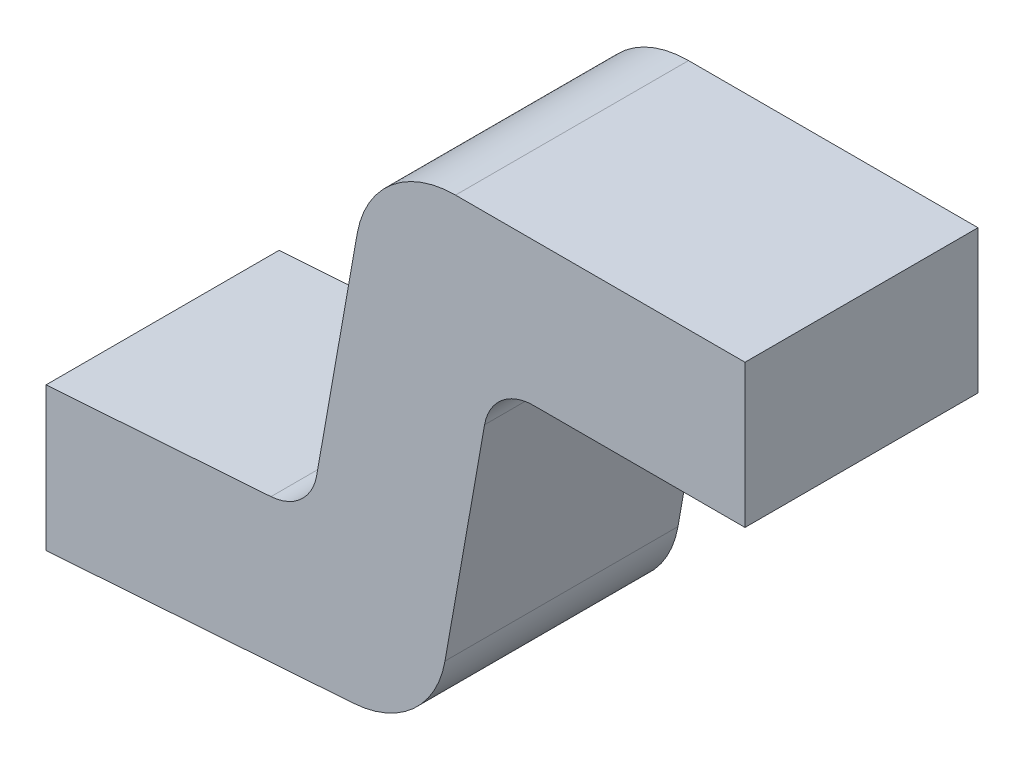
ISO-10303-21;
HEADER;
FILE_DESCRIPTION(('STEP AP214'),'2;1');
FILE_NAME('part.step','',(''),(''),'','','');
FILE_SCHEMA(('AUTOMOTIVE_DESIGN { 1 0 10303 214 1 1 1 1 }'));
ENDSEC;
DATA;
#1=APPLICATION_CONTEXT('core data for automotive mechanical design processes');
#2=APPLICATION_PROTOCOL_DEFINITION('international standard','automotive_design',2000,#1);
#3=PRODUCT_CONTEXT('',#1,'mechanical');
#4=PRODUCT('Part','Part','',(#3));
#5=PRODUCT_RELATED_PRODUCT_CATEGORY('part','',(#4));
#6=PRODUCT_DEFINITION_FORMATION('','',#4);
#7=PRODUCT_DEFINITION_CONTEXT('part definition',#1,'design');
#8=PRODUCT_DEFINITION('design','',#6,#7);
#9=PRODUCT_DEFINITION_SHAPE('','',#8);
#10=(LENGTH_UNIT() NAMED_UNIT(*) SI_UNIT(.MILLI.,.METRE.));
#11=(NAMED_UNIT(*) PLANE_ANGLE_UNIT() SI_UNIT($,.RADIAN.));
#12=(NAMED_UNIT(*) SI_UNIT($,.STERADIAN.) SOLID_ANGLE_UNIT());
#13=UNCERTAINTY_MEASURE_WITH_UNIT(LENGTH_MEASURE(1.E-05),#10,'distance_accuracy_value','');
#14=(GEOMETRIC_REPRESENTATION_CONTEXT(3) GLOBAL_UNCERTAINTY_ASSIGNED_CONTEXT((#13)) GLOBAL_UNIT_ASSIGNED_CONTEXT((#10,
#11,#12)) REPRESENTATION_CONTEXT('',''));
#15=CARTESIAN_POINT('',(0.,0.,0.));
#16=DIRECTION('',(0.,0.,1.));
#17=DIRECTION('',(1.,0.,0.));
#18=AXIS2_PLACEMENT_3D('',#15,#16,#17);
#19=CARTESIAN_POINT('',(0.526665309674,0.392731120359,0.));
#20=DIRECTION('',(0.,0.,1.));
#21=DIRECTION('',(1.,0.,0.));
#22=AXIS2_PLACEMENT_3D('',#19,#20,#21);
#23=PLANE('',#22);
#24=DIRECTION('',(0.997564050259825,0.0697564737441177,0.));
#25=VECTOR('',#24,1.);
#26=CARTESIAN_POINT('',(0.,0.,0.));
#27=LINE('',#26,#25);
#28=CARTESIAN_POINT('',(0.,0.,0.));
#29=VERTEX_POINT('',#28);
#30=CARTESIAN_POINT('',(0.462092631901793,0.032312664571475,0.));
#31=VERTEX_POINT('',#30);
#32=EDGE_CURVE('E106',#29,#31,#27,.T.);
#33=ORIENTED_EDGE('',*,*,#32,.F.);
#34=DIRECTION('',(0.,-1.,0.));
#35=VECTOR('',#34,1.);
#36=CARTESIAN_POINT('',(0.,0.215525008087,0.));
#37=LINE('',#36,#35);
#38=CARTESIAN_POINT('',(0.,0.215525008087024,0.));
#39=VERTEX_POINT('',#38);
#40=EDGE_CURVE('E130',#39,#29,#37,.T.);
#41=ORIENTED_EDGE('',*,*,#40,.F.);
#42=DIRECTION('',(-0.997564050259825,-0.0697564737441177,0.));
#43=VECTOR('',#42,1.);
#44=CARTESIAN_POINT('',(0.396435130538,0.243246452908,0.));
#45=LINE('',#44,#43);
#46=CARTESIAN_POINT('',(0.337981446488916,0.239158973136095,0.));
#47=VERTEX_POINT('',#46);
#48=EDGE_CURVE('E132',#47,#39,#45,.T.);
#49=ORIENTED_EDGE('',*,*,#48,.F.);
#50=CARTESIAN_POINT('',(0.332749710958,0.313976276906,0.));
#51=DIRECTION('',(0.,0.,1.));
#52=DIRECTION('',(1.,0.,0.));
#53=AXIS2_PLACEMENT_3D('',#50,#51,#52);
#54=CIRCLE('',#53,0.075);
#55=CARTESIAN_POINT('',(0.406610292433879,0.300952663581,0.));
#56=VERTEX_POINT('',#55);
#57=EDGE_CURVE('E176',#47,#56,#54,.T.);
#58=ORIENTED_EDGE('',*,*,#57,.T.);
#59=DIRECTION('',(-0.173648177667033,-0.98480775301219,0.));
#60=VECTOR('',#59,1.);
#61=CARTESIAN_POINT('',(0.489315993074,0.77,0.));
#62=LINE('',#61,#60);
#63=CARTESIAN_POINT('',(0.467459774798741,0.64604722665,0.));
#64=VERTEX_POINT('',#63);
#65=EDGE_CURVE('E140',#64,#56,#62,.T.);
#66=ORIENTED_EDGE('',*,*,#65,.F.);
#67=CARTESIAN_POINT('',(0.61518093775,0.62,0.));
#68=DIRECTION('',(0.,0.,1.));
#69=DIRECTION('',(1.,0.,0.));
#70=AXIS2_PLACEMENT_3D('',#67,#68,#69);
#71=CIRCLE('',#70,0.15);
#72=CARTESIAN_POINT('',(0.61518093775,0.77,0.));
#73=VERTEX_POINT('',#72);
#74=EDGE_CURVE('E179',#73,#64,#71,.T.);
#75=ORIENTED_EDGE('',*,*,#74,.F.);
#76=DIRECTION('',(-1.,0.,0.));
#77=VECTOR('',#76,1.);
#78=CARTESIAN_POINT('',(1.05,0.77,0.));
#79=LINE('',#78,#77);
#80=CARTESIAN_POINT('',(1.05,0.77,0.));
#81=VERTEX_POINT('',#80);
#82=EDGE_CURVE('E144',#81,#73,#79,.T.);
#83=ORIENTED_EDGE('',*,*,#82,.F.);
#84=DIRECTION('',(0.,1.,0.));
#85=VECTOR('',#84,1.);
#86=CARTESIAN_POINT('',(1.05,0.555,0.));
#87=LINE('',#86,#85);
#88=CARTESIAN_POINT('',(1.05,0.555,0.));
#89=VERTEX_POINT('',#88);
#90=EDGE_CURVE('E150',#89,#81,#87,.T.);
#91=ORIENTED_EDGE('',*,*,#90,.F.);
#92=DIRECTION('',(1.,0.,0.));
#93=VECTOR('',#92,1.);
#94=CARTESIAN_POINT('',(0.669722413777,0.555,0.));
#95=LINE('',#94,#93);
#96=CARTESIAN_POINT('',(0.732654886115,0.555,0.));
#97=VERTEX_POINT('',#96);
#98=EDGE_CURVE('E153',#97,#89,#95,.T.);
#99=ORIENTED_EDGE('',*,*,#98,.F.);
#100=CARTESIAN_POINT('',(0.732654886115,0.48,0.));
#101=DIRECTION('',(0.,0.,1.));
#102=DIRECTION('',(1.,0.,0.));
#103=AXIS2_PLACEMENT_3D('',#100,#101,#102);
#104=CIRCLE('',#103,0.075);
#105=CARTESIAN_POINT('',(0.658794304639196,0.493023613324987,0.));
#106=VERTEX_POINT('',#105);
#107=EDGE_CURVE('E180',#97,#106,#104,.T.);
#108=ORIENTED_EDGE('',*,*,#107,.T.);
#109=DIRECTION('',(0.173648177667033,0.98480775301219,0.));
#110=VECTOR('',#109,1.);
#111=CARTESIAN_POINT('',(0.579,0.04048762411529,0.));
#112=LINE('',#111,#110);
#113=CARTESIAN_POINT('',(0.599350323791972,0.155900045459962,0.));
#114=VERTEX_POINT('',#113);
#115=EDGE_CURVE('E108',#114,#106,#112,.T.);
#116=ORIENTED_EDGE('',*,*,#115,.F.);
#117=CARTESIAN_POINT('',(0.45162916084,0.18194727211,0.));
#118=DIRECTION('',(0.,0.,1.));
#119=DIRECTION('',(1.,0.,0.));
#120=AXIS2_PLACEMENT_3D('',#117,#118,#119);
#121=CIRCLE('',#120,0.15);
#122=EDGE_CURVE('E20',#31,#114,#121,.T.);
#123=ORIENTED_EDGE('',*,*,#122,.F.);
#124=EDGE_LOOP('',(#33,#41,#49,#58,#66,#75,#83,#91,#99,#108,#116,#123));
#125=FACE_BOUND('',#124,.T.);
#126=ADVANCED_FACE('F17',(#125),#23,.F.);
#127=CARTESIAN_POINT('',(0.45162916084,0.18194727211,0.));
#128=DIRECTION('',(0.,0.,1.));
#129=DIRECTION('',(1.,0.,0.));
#130=AXIS2_PLACEMENT_3D('',#127,#128,#129);
#131=CYLINDRICAL_SURFACE('',#130,0.15);
#132=ORIENTED_EDGE('',*,*,#122,.T.);
#133=DIRECTION('',(0.,0.,1.));
#134=VECTOR('',#133,1.);
#135=CARTESIAN_POINT('',(0.599350323791979,0.155900045460004,0.));
#136=LINE('',#135,#134);
#137=CARTESIAN_POINT('',(0.599350323791995,0.155900045460032,0.35));
#138=VERTEX_POINT('',#137);
#139=EDGE_CURVE('E111',#138,#114,#136,.F.);
#140=ORIENTED_EDGE('',*,*,#139,.F.);
#141=CARTESIAN_POINT('',(0.45162916084,0.18194727211,0.35));
#142=DIRECTION('',(0.,0.,1.));
#143=DIRECTION('',(1.,0.,0.));
#144=AXIS2_PLACEMENT_3D('',#141,#142,#143);
#145=CIRCLE('',#144,0.15);
#146=CARTESIAN_POINT('',(0.462092631901792,0.0323126645714702,0.35));
#147=VERTEX_POINT('',#146);
#148=EDGE_CURVE('E116',#147,#138,#145,.T.);
#149=ORIENTED_EDGE('',*,*,#148,.F.);
#150=DIRECTION('',(0.,0.,1.));
#151=VECTOR('',#150,1.);
#152=CARTESIAN_POINT('',(0.462092631901999,0.0323126645714894,0.));
#153=LINE('',#152,#151);
#154=EDGE_CURVE('E113',#31,#147,#153,.T.);
#155=ORIENTED_EDGE('',*,*,#154,.F.);
#156=EDGE_LOOP('',(#132,#140,#149,#155));
#157=FACE_BOUND('',#156,.T.);
#158=ADVANCED_FACE('F114',(#157),#131,.T.);
#159=CARTESIAN_POINT('',(0.579,0.04048762411529,0.));
#160=DIRECTION('',(0.98480775301219,-0.173648177667033,0.));
#161=DIRECTION('',(0.173648177667033,0.98480775301219,0.));
#162=AXIS2_PLACEMENT_3D('',#159,#160,#161);
#163=PLANE('',#162);
#164=ORIENTED_EDGE('',*,*,#139,.T.);
#165=ORIENTED_EDGE('',*,*,#115,.T.);
#166=DIRECTION('',(0.,0.,1.));
#167=VECTOR('',#166,1.);
#168=CARTESIAN_POINT('',(0.658794304639078,0.493023613324986,0.));
#169=LINE('',#168,#167);
#170=CARTESIAN_POINT('',(0.658794304639037,0.493023613324978,0.35));
#171=VERTEX_POINT('',#170);
#172=EDGE_CURVE('E162',#106,#171,#169,.T.);
#173=ORIENTED_EDGE('',*,*,#172,.T.);
#174=DIRECTION('',(0.173648177666078,0.984807753012358,0.));
#175=VECTOR('',#174,1.);
#176=CARTESIAN_POINT('',(0.599350323792,0.15590004546,0.35));
#177=LINE('',#176,#175);
#178=EDGE_CURVE('E122',#138,#171,#177,.T.);
#179=ORIENTED_EDGE('',*,*,#178,.F.);
#180=EDGE_LOOP('',(#164,#165,#173,#179));
#181=FACE_BOUND('',#180,.T.);
#182=ADVANCED_FACE('F346',(#181),#163,.T.);
#183=CARTESIAN_POINT('',(0.732654886115,0.48,0.));
#184=DIRECTION('',(0.,0.,1.));
#185=DIRECTION('',(1.,0.,0.));
#186=AXIS2_PLACEMENT_3D('',#183,#184,#185);
#187=CYLINDRICAL_SURFACE('',#186,0.075);
#188=DIRECTION('',(0.,0.,1.));
#189=VECTOR('',#188,1.);
#190=CARTESIAN_POINT('',(0.732654886115,0.555,0.));
#191=LINE('',#190,#189);
#192=CARTESIAN_POINT('',(0.732654886115,0.555,0.35));
#193=VERTEX_POINT('',#192);
#194=EDGE_CURVE('E158',#193,#97,#191,.F.);
#195=ORIENTED_EDGE('',*,*,#194,.F.);
#196=CARTESIAN_POINT('',(0.732654886115,0.48,0.35));
#197=DIRECTION('',(0.,0.,1.));
#198=DIRECTION('',(1.,0.,0.));
#199=AXIS2_PLACEMENT_3D('',#196,#197,#198);
#200=CIRCLE('',#199,0.075);
#201=EDGE_CURVE('E172',#171,#193,#200,.F.);
#202=ORIENTED_EDGE('',*,*,#201,.F.);
#203=ORIENTED_EDGE('',*,*,#172,.F.);
#204=ORIENTED_EDGE('',*,*,#107,.F.);
#205=EDGE_LOOP('',(#195,#202,#203,#204));
#206=FACE_BOUND('',#205,.T.);
#207=ADVANCED_FACE('F336',(#206),#187,.F.);
#208=CARTESIAN_POINT('',(0.669722413777,0.555,0.));
#209=DIRECTION('',(0.,-1.,0.));
#210=DIRECTION('',(1.,0.,0.));
#211=AXIS2_PLACEMENT_3D('',#208,#209,#210);
#212=PLANE('',#211);
#213=DIRECTION('',(0.,0.,1.));
#214=VECTOR('',#213,1.);
#215=CARTESIAN_POINT('',(1.05,0.555,0.));
#216=LINE('',#215,#214);
#217=CARTESIAN_POINT('',(1.05,0.555,0.35));
#218=VERTEX_POINT('',#217);
#219=EDGE_CURVE('E152',#218,#89,#216,.F.);
#220=ORIENTED_EDGE('',*,*,#219,.F.);
#221=DIRECTION('',(1.,0.,0.));
#222=VECTOR('',#221,1.);
#223=CARTESIAN_POINT('',(0.526665309674,0.555,0.35));
#224=LINE('',#223,#222);
#225=EDGE_CURVE('E174',#193,#218,#224,.T.);
#226=ORIENTED_EDGE('',*,*,#225,.F.);
#227=ORIENTED_EDGE('',*,*,#194,.T.);
#228=ORIENTED_EDGE('',*,*,#98,.T.);
#229=EDGE_LOOP('',(#220,#226,#227,#228));
#230=FACE_BOUND('',#229,.T.);
#231=ADVANCED_FACE('F326',(#230),#212,.T.);
#232=CARTESIAN_POINT('',(1.05,0.555,0.));
#233=DIRECTION('',(1.,0.,0.));
#234=DIRECTION('',(0.,1.,0.));
#235=AXIS2_PLACEMENT_3D('',#232,#233,#234);
#236=PLANE('',#235);
#237=DIRECTION('',(0.,1.,0.));
#238=VECTOR('',#237,1.);
#239=CARTESIAN_POINT('',(1.05,0.392731120359,0.35));
#240=LINE('',#239,#238);
#241=CARTESIAN_POINT('',(1.05,0.77,0.35));
#242=VERTEX_POINT('',#241);
#243=EDGE_CURVE('E195',#218,#242,#240,.T.);
#244=ORIENTED_EDGE('',*,*,#243,.F.);
#245=ORIENTED_EDGE('',*,*,#219,.T.);
#246=ORIENTED_EDGE('',*,*,#90,.T.);
#247=DIRECTION('',(0.,0.,1.));
#248=VECTOR('',#247,1.);
#249=CARTESIAN_POINT('',(1.05,0.77,0.));
#250=LINE('',#249,#248);
#251=EDGE_CURVE('E147',#242,#81,#250,.F.);
#252=ORIENTED_EDGE('',*,*,#251,.F.);
#253=EDGE_LOOP('',(#244,#245,#246,#252));
#254=FACE_BOUND('',#253,.T.);
#255=ADVANCED_FACE('F316',(#254),#236,.T.);
#256=CARTESIAN_POINT('',(1.05,0.77,0.));
#257=DIRECTION('',(0.,1.,0.));
#258=DIRECTION('',(-1.,0.,0.));
#259=AXIS2_PLACEMENT_3D('',#256,#257,#258);
#260=PLANE('',#259);
#261=ORIENTED_EDGE('',*,*,#251,.T.);
#262=ORIENTED_EDGE('',*,*,#82,.T.);
#263=DIRECTION('',(0.,0.,1.));
#264=VECTOR('',#263,1.);
#265=CARTESIAN_POINT('',(0.61518093775,0.77,0.));
#266=LINE('',#265,#264);
#267=CARTESIAN_POINT('',(0.61518093775,0.77,0.35));
#268=VERTEX_POINT('',#267);
#269=EDGE_CURVE('E146',#268,#73,#266,.F.);
#270=ORIENTED_EDGE('',*,*,#269,.F.);
#271=DIRECTION('',(1.,0.,0.));
#272=VECTOR('',#271,1.);
#273=CARTESIAN_POINT('',(0.526665309674,0.77,0.35));
#274=LINE('',#273,#272);
#275=EDGE_CURVE('E171',#242,#268,#274,.F.);
#276=ORIENTED_EDGE('',*,*,#275,.F.);
#277=EDGE_LOOP('',(#261,#262,#270,#276));
#278=FACE_BOUND('',#277,.T.);
#279=ADVANCED_FACE('F306',(#278),#260,.T.);
#280=CARTESIAN_POINT('',(0.61518093775,0.62,0.));
#281=DIRECTION('',(0.,0.,1.));
#282=DIRECTION('',(1.,0.,0.));
#283=AXIS2_PLACEMENT_3D('',#280,#281,#282);
#284=CYLINDRICAL_SURFACE('',#283,0.15);
#285=ORIENTED_EDGE('',*,*,#74,.T.);
#286=DIRECTION('',(0.,0.,1.));
#287=VECTOR('',#286,1.);
#288=CARTESIAN_POINT('',(0.467459774798748,0.646047226650044,0.));
#289=LINE('',#288,#287);
#290=CARTESIAN_POINT('',(0.46745977479887,0.646047226649999,0.35));
#291=VERTEX_POINT('',#290);
#292=EDGE_CURVE('E143',#291,#64,#289,.F.);
#293=ORIENTED_EDGE('',*,*,#292,.F.);
#294=CARTESIAN_POINT('',(0.61518093775,0.62,0.35));
#295=DIRECTION('',(0.,0.,1.));
#296=DIRECTION('',(1.,0.,0.));
#297=AXIS2_PLACEMENT_3D('',#294,#295,#296);
#298=CIRCLE('',#297,0.15);
#299=EDGE_CURVE('E168',#268,#291,#298,.T.);
#300=ORIENTED_EDGE('',*,*,#299,.F.);
#301=ORIENTED_EDGE('',*,*,#269,.T.);
#302=EDGE_LOOP('',(#285,#293,#300,#301));
#303=FACE_BOUND('',#302,.T.);
#304=ADVANCED_FACE('F296',(#303),#284,.T.);
#305=CARTESIAN_POINT('',(0.489315993074,0.77,0.));
#306=DIRECTION('',(-0.98480775301219,0.173648177667033,0.));
#307=DIRECTION('',(-0.173648177667033,-0.98480775301219,0.));
#308=AXIS2_PLACEMENT_3D('',#305,#306,#307);
#309=PLANE('',#308);
#310=ORIENTED_EDGE('',*,*,#292,.T.);
#311=ORIENTED_EDGE('',*,*,#65,.T.);
#312=DIRECTION('',(0.,0.,1.));
#313=VECTOR('',#312,1.);
#314=CARTESIAN_POINT('',(0.406610292433922,0.300952663581014,0.));
#315=LINE('',#314,#313);
#316=CARTESIAN_POINT('',(0.406610292433955,0.300952663580976,0.35));
#317=VERTEX_POINT('',#316);
#318=EDGE_CURVE('E142',#56,#317,#315,.T.);
#319=ORIENTED_EDGE('',*,*,#318,.T.);
#320=DIRECTION('',(-0.173648177667308,-0.984807753012142,0.));
#321=VECTOR('',#320,1.);
#322=CARTESIAN_POINT('',(0.467459774799,0.64604722665,0.35));
#323=LINE('',#322,#321);
#324=EDGE_CURVE('E167',#291,#317,#323,.T.);
#325=ORIENTED_EDGE('',*,*,#324,.F.);
#326=EDGE_LOOP('',(#310,#311,#319,#325));
#327=FACE_BOUND('',#326,.T.);
#328=ADVANCED_FACE('F286',(#327),#309,.T.);
#329=CARTESIAN_POINT('',(0.332749710958,0.313976276906,0.));
#330=DIRECTION('',(0.,0.,1.));
#331=DIRECTION('',(1.,0.,0.));
#332=AXIS2_PLACEMENT_3D('',#329,#330,#331);
#333=CYLINDRICAL_SURFACE('',#332,0.075);
#334=DIRECTION('',(0.,0.,1.));
#335=VECTOR('',#334,1.);
#336=CARTESIAN_POINT('',(0.337981446488993,0.2391589731361,0.));
#337=LINE('',#336,#335);
#338=CARTESIAN_POINT('',(0.337981446488916,0.239158973136044,0.35));
#339=VERTEX_POINT('',#338);
#340=EDGE_CURVE('E137',#339,#47,#337,.F.);
#341=ORIENTED_EDGE('',*,*,#340,.F.);
#342=CARTESIAN_POINT('',(0.332749710958,0.313976276906,0.35));
#343=DIRECTION('',(0.,0.,1.));
#344=DIRECTION('',(1.,0.,0.));
#345=AXIS2_PLACEMENT_3D('',#342,#343,#344);
#346=CIRCLE('',#345,0.075);
#347=EDGE_CURVE('E163',#317,#339,#346,.F.);
#348=ORIENTED_EDGE('',*,*,#347,.F.);
#349=ORIENTED_EDGE('',*,*,#318,.F.);
#350=ORIENTED_EDGE('',*,*,#57,.F.);
#351=EDGE_LOOP('',(#341,#348,#349,#350));
#352=FACE_BOUND('',#351,.T.);
#353=ADVANCED_FACE('F252',(#352),#333,.F.);
#354=CARTESIAN_POINT('',(0.396435130538,0.243246452908,0.));
#355=DIRECTION('',(-0.0697564737441177,0.997564050259825,0.));
#356=DIRECTION('',(-0.997564050259825,-0.0697564737441177,0.));
#357=AXIS2_PLACEMENT_3D('',#354,#355,#356);
#358=PLANE('',#357);
#359=DIRECTION('',(0.,0.,1.));
#360=VECTOR('',#359,1.);
#361=CARTESIAN_POINT('',(0.,0.215525008087,0.));
#362=LINE('',#361,#360);
#363=CARTESIAN_POINT('',(0.,0.215525008087,0.35));
#364=VERTEX_POINT('',#363);
#365=EDGE_CURVE('E118',#364,#39,#362,.F.);
#366=ORIENTED_EDGE('',*,*,#365,.F.);
#367=DIRECTION('',(-0.997564050259831,-0.0697564737440315,0.));
#368=VECTOR('',#367,1.);
#369=CARTESIAN_POINT('',(0.337981446489,0.239158973136,0.35));
#370=LINE('',#369,#368);
#371=EDGE_CURVE('E166',#339,#364,#370,.T.);
#372=ORIENTED_EDGE('',*,*,#371,.F.);
#373=ORIENTED_EDGE('',*,*,#340,.T.);
#374=ORIENTED_EDGE('',*,*,#48,.T.);
#375=EDGE_LOOP('',(#366,#372,#373,#374));
#376=FACE_BOUND('',#375,.T.);
#377=ADVANCED_FACE('F241',(#376),#358,.T.);
#378=CARTESIAN_POINT('',(0.,0.215525008087,0.));
#379=DIRECTION('',(-1.,0.,0.));
#380=DIRECTION('',(0.,-1.,0.));
#381=AXIS2_PLACEMENT_3D('',#378,#379,#380);
#382=PLANE('',#381);
#383=DIRECTION('',(0.,1.,0.));
#384=VECTOR('',#383,1.);
#385=CARTESIAN_POINT('',(0.,0.392731120359,0.35));
#386=LINE('',#385,#384);
#387=CARTESIAN_POINT('',(0.,0.,0.35));
#388=VERTEX_POINT('',#387);
#389=EDGE_CURVE('E26',#364,#388,#386,.F.);
#390=ORIENTED_EDGE('',*,*,#389,.F.);
#391=ORIENTED_EDGE('',*,*,#365,.T.);
#392=ORIENTED_EDGE('',*,*,#40,.T.);
#393=DIRECTION('',(0.,0.,1.));
#394=VECTOR('',#393,1.);
#395=CARTESIAN_POINT('',(0.,0.,0.));
#396=LINE('',#395,#394);
#397=EDGE_CURVE('E35',#388,#29,#396,.F.);
#398=ORIENTED_EDGE('',*,*,#397,.F.);
#399=EDGE_LOOP('',(#390,#391,#392,#398));
#400=FACE_BOUND('',#399,.T.);
#401=ADVANCED_FACE('F243',(#400),#382,.T.);
#402=CARTESIAN_POINT('',(0.,0.,0.));
#403=DIRECTION('',(0.0697564737441177,-0.997564050259825,0.));
#404=DIRECTION('',(0.997564050259825,0.0697564737441177,0.));
#405=AXIS2_PLACEMENT_3D('',#402,#403,#404);
#406=PLANE('',#405);
#407=ORIENTED_EDGE('',*,*,#397,.T.);
#408=ORIENTED_EDGE('',*,*,#32,.T.);
#409=ORIENTED_EDGE('',*,*,#154,.T.);
#410=DIRECTION('',(0.997564050259826,0.0697564737440975,0.));
#411=VECTOR('',#410,1.);
#412=CARTESIAN_POINT('',(0.,0.,0.35));
#413=LINE('',#412,#411);
#414=EDGE_CURVE('E11',#388,#147,#413,.T.);
#415=ORIENTED_EDGE('',*,*,#414,.F.);
#416=EDGE_LOOP('',(#407,#408,#409,#415));
#417=FACE_BOUND('',#416,.T.);
#418=ADVANCED_FACE('F120',(#417),#406,.T.);
#419=CARTESIAN_POINT('',(0.526665309674,0.392731120359,0.35));
#420=DIRECTION('',(0.,0.,1.));
#421=DIRECTION('',(1.,0.,0.));
#422=AXIS2_PLACEMENT_3D('',#419,#420,#421);
#423=PLANE('',#422);
#424=ORIENTED_EDGE('',*,*,#389,.T.);
#425=ORIENTED_EDGE('',*,*,#414,.T.);
#426=ORIENTED_EDGE('',*,*,#148,.T.);
#427=ORIENTED_EDGE('',*,*,#178,.T.);
#428=ORIENTED_EDGE('',*,*,#201,.T.);
#429=ORIENTED_EDGE('',*,*,#225,.T.);
#430=ORIENTED_EDGE('',*,*,#243,.T.);
#431=ORIENTED_EDGE('',*,*,#275,.T.);
#432=ORIENTED_EDGE('',*,*,#299,.T.);
#433=ORIENTED_EDGE('',*,*,#324,.T.);
#434=ORIENTED_EDGE('',*,*,#347,.T.);
#435=ORIENTED_EDGE('',*,*,#371,.T.);
#436=EDGE_LOOP('',(#424,#425,#426,#427,#428,#429,#430,#431,#432,#433,#434,#435));
#437=FACE_BOUND('',#436,.T.);
#438=ADVANCED_FACE('F238',(#437),#423,.T.);
#439=CLOSED_SHELL('',(#126,#158,#182,#207,#231,#255,#279,#304,#328,#353,#377,#401,#418,#438));
#440=MANIFOLD_SOLID_BREP('B1',#439);
#441=ADVANCED_BREP_SHAPE_REPRESENTATION('',(#18,#440),#14);
#442=SHAPE_DEFINITION_REPRESENTATION(#9,#441);
ENDSEC;
END-ISO-10303-21;
